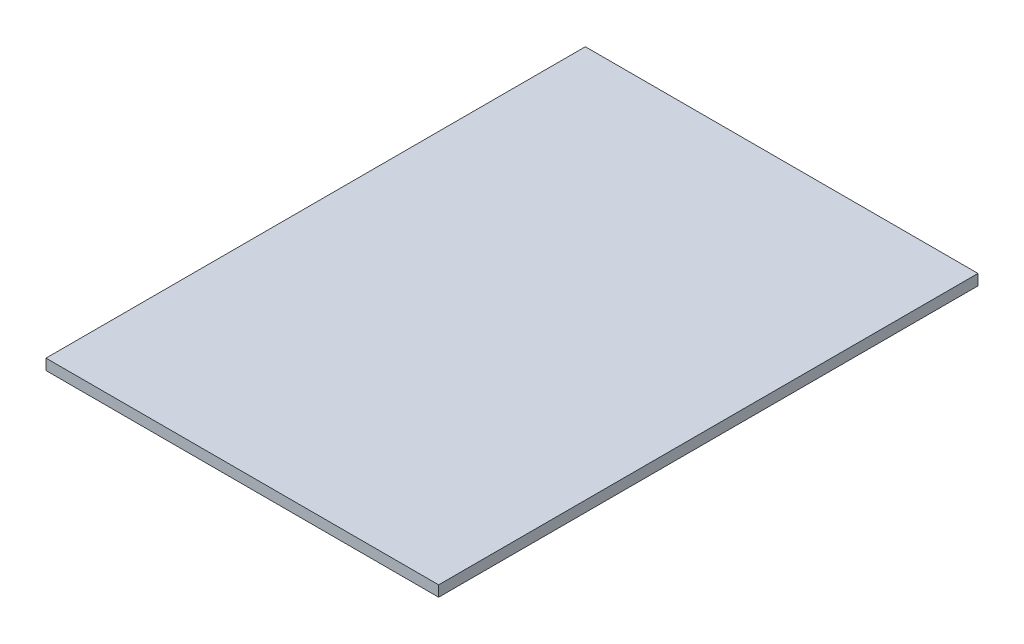
ISO-10303-21;
HEADER;
FILE_DESCRIPTION(('STEP AP214'),'2;1');
FILE_NAME('part.step','',(''),(''),'','','');
FILE_SCHEMA(('AUTOMOTIVE_DESIGN { 1 0 10303 214 1 1 1 1 }'));
ENDSEC;
DATA;
#1=APPLICATION_CONTEXT('core data for automotive mechanical design processes');
#2=APPLICATION_PROTOCOL_DEFINITION('international standard','automotive_design',2000,#1);
#3=PRODUCT_CONTEXT('',#1,'mechanical');
#4=PRODUCT('Part','Part','',(#3));
#5=PRODUCT_RELATED_PRODUCT_CATEGORY('part','',(#4));
#6=PRODUCT_DEFINITION_FORMATION('','',#4);
#7=PRODUCT_DEFINITION_CONTEXT('part definition',#1,'design');
#8=PRODUCT_DEFINITION('design','',#6,#7);
#9=PRODUCT_DEFINITION_SHAPE('','',#8);
#10=(LENGTH_UNIT() NAMED_UNIT(*) SI_UNIT(.MILLI.,.METRE.));
#11=(NAMED_UNIT(*) PLANE_ANGLE_UNIT() SI_UNIT($,.RADIAN.));
#12=(NAMED_UNIT(*) SI_UNIT($,.STERADIAN.) SOLID_ANGLE_UNIT());
#13=UNCERTAINTY_MEASURE_WITH_UNIT(LENGTH_MEASURE(1.E-05),#10,'distance_accuracy_value','');
#14=(GEOMETRIC_REPRESENTATION_CONTEXT(3) GLOBAL_UNCERTAINTY_ASSIGNED_CONTEXT((#13)) GLOBAL_UNIT_ASSIGNED_CONTEXT((#10,
#11,#12)) REPRESENTATION_CONTEXT('',''));
#15=CARTESIAN_POINT('',(0.,0.,0.));
#16=DIRECTION('',(0.,0.,1.));
#17=DIRECTION('',(1.,0.,0.));
#18=AXIS2_PLACEMENT_3D('',#15,#16,#17);
#19=CARTESIAN_POINT('',(1.82,0.1,-2.5));
#20=DIRECTION('',(-1.,0.,0.));
#21=DIRECTION('',(0.,0.,1.));
#22=AXIS2_PLACEMENT_3D('',#19,#20,#21);
#23=PLANE('',#22);
#24=DIRECTION('',(0.,0.,-1.));
#25=VECTOR('',#24,1.);
#26=CARTESIAN_POINT('',(1.82,0.,-2.5));
#27=LINE('',#26,#25);
#28=CARTESIAN_POINT('',(1.82,0.,2.5));
#29=VERTEX_POINT('',#28);
#30=CARTESIAN_POINT('',(1.82,0.,-2.5));
#31=VERTEX_POINT('',#30);
#32=EDGE_CURVE('E98',#29,#31,#27,.T.);
#33=ORIENTED_EDGE('',*,*,#32,.T.);
#34=DIRECTION('',(0.,-1.,0.));
#35=VECTOR('',#34,1.);
#36=CARTESIAN_POINT('',(1.82,0.1,-2.5));
#37=LINE('',#36,#35);
#38=CARTESIAN_POINT('',(1.82,0.1,-2.5));
#39=VERTEX_POINT('',#38);
#40=EDGE_CURVE('E11',#39,#31,#37,.T.);
#41=ORIENTED_EDGE('',*,*,#40,.F.);
#42=DIRECTION('',(0.,0.,-1.));
#43=VECTOR('',#42,1.);
#44=CARTESIAN_POINT('',(1.82,0.1,-2.5));
#45=LINE('',#44,#43);
#46=CARTESIAN_POINT('',(1.82,0.1,2.5));
#47=VERTEX_POINT('',#46);
#48=EDGE_CURVE('E86',#47,#39,#45,.T.);
#49=ORIENTED_EDGE('',*,*,#48,.F.);
#50=DIRECTION('',(0.,-1.,0.));
#51=VECTOR('',#50,1.);
#52=CARTESIAN_POINT('',(1.82,0.1,2.5));
#53=LINE('',#52,#51);
#54=EDGE_CURVE('E94',#47,#29,#53,.T.);
#55=ORIENTED_EDGE('',*,*,#54,.T.);
#56=EDGE_LOOP('',(#33,#41,#49,#55));
#57=FACE_BOUND('',#56,.T.);
#58=ADVANCED_FACE('F35',(#57),#23,.F.);
#59=CARTESIAN_POINT('',(-1.82,0.1,-2.5));
#60=DIRECTION('',(0.,0.,1.));
#61=DIRECTION('',(1.,0.,0.));
#62=AXIS2_PLACEMENT_3D('',#59,#60,#61);
#63=PLANE('',#62);
#64=DIRECTION('',(-1.,0.,0.));
#65=VECTOR('',#64,1.);
#66=CARTESIAN_POINT('',(-1.82,0.,-2.5));
#67=LINE('',#66,#65);
#68=CARTESIAN_POINT('',(-1.82,0.,-2.5));
#69=VERTEX_POINT('',#68);
#70=EDGE_CURVE('E90',#31,#69,#67,.T.);
#71=ORIENTED_EDGE('',*,*,#70,.T.);
#72=DIRECTION('',(0.,-1.,0.));
#73=VECTOR('',#72,1.);
#74=CARTESIAN_POINT('',(-1.82,0.1,-2.5));
#75=LINE('',#74,#73);
#76=CARTESIAN_POINT('',(-1.82,0.1,-2.5));
#77=VERTEX_POINT('',#76);
#78=EDGE_CURVE('E43',#77,#69,#75,.T.);
#79=ORIENTED_EDGE('',*,*,#78,.F.);
#80=DIRECTION('',(-1.,0.,0.));
#81=VECTOR('',#80,1.);
#82=CARTESIAN_POINT('',(-1.82,0.1,-2.5));
#83=LINE('',#82,#81);
#84=EDGE_CURVE('E81',#39,#77,#83,.T.);
#85=ORIENTED_EDGE('',*,*,#84,.F.);
#86=ORIENTED_EDGE('',*,*,#40,.T.);
#87=EDGE_LOOP('',(#71,#79,#85,#86));
#88=FACE_BOUND('',#87,.T.);
#89=ADVANCED_FACE('F89',(#88),#63,.F.);
#90=CARTESIAN_POINT('',(-1.82,0.1,-2.5));
#91=DIRECTION('',(1.,0.,0.));
#92=DIRECTION('',(0.,0.,-1.));
#93=AXIS2_PLACEMENT_3D('',#90,#91,#92);
#94=PLANE('',#93);
#95=DIRECTION('',(0.,0.,1.));
#96=VECTOR('',#95,1.);
#97=CARTESIAN_POINT('',(-1.82,0.,-2.5));
#98=LINE('',#97,#96);
#99=CARTESIAN_POINT('',(-1.82,0.,2.5));
#100=VERTEX_POINT('',#99);
#101=EDGE_CURVE('E68',#69,#100,#98,.T.);
#102=ORIENTED_EDGE('',*,*,#101,.T.);
#103=DIRECTION('',(0.,-1.,0.));
#104=VECTOR('',#103,1.);
#105=CARTESIAN_POINT('',(-1.82,0.1,2.5));
#106=LINE('',#105,#104);
#107=CARTESIAN_POINT('',(-1.82,0.1,2.5));
#108=VERTEX_POINT('',#107);
#109=EDGE_CURVE('E91',#108,#100,#106,.T.);
#110=ORIENTED_EDGE('',*,*,#109,.F.);
#111=DIRECTION('',(0.,0.,1.));
#112=VECTOR('',#111,1.);
#113=CARTESIAN_POINT('',(-1.82,0.1,-2.5));
#114=LINE('',#113,#112);
#115=EDGE_CURVE('E84',#77,#108,#114,.T.);
#116=ORIENTED_EDGE('',*,*,#115,.F.);
#117=ORIENTED_EDGE('',*,*,#78,.T.);
#118=EDGE_LOOP('',(#102,#110,#116,#117));
#119=FACE_BOUND('',#118,.T.);
#120=ADVANCED_FACE('F92',(#119),#94,.F.);
#121=CARTESIAN_POINT('',(-1.82,0.1,2.5));
#122=DIRECTION('',(0.,0.,-1.));
#123=DIRECTION('',(-1.,0.,0.));
#124=AXIS2_PLACEMENT_3D('',#121,#122,#123);
#125=PLANE('',#124);
#126=DIRECTION('',(1.,0.,0.));
#127=VECTOR('',#126,1.);
#128=CARTESIAN_POINT('',(-1.82,0.,2.5));
#129=LINE('',#128,#127);
#130=EDGE_CURVE('E74',#100,#29,#129,.T.);
#131=ORIENTED_EDGE('',*,*,#130,.T.);
#132=ORIENTED_EDGE('',*,*,#54,.F.);
#133=DIRECTION('',(1.,0.,0.));
#134=VECTOR('',#133,1.);
#135=CARTESIAN_POINT('',(-1.82,0.1,2.5));
#136=LINE('',#135,#134);
#137=EDGE_CURVE('E51',#108,#47,#136,.T.);
#138=ORIENTED_EDGE('',*,*,#137,.F.);
#139=ORIENTED_EDGE('',*,*,#109,.T.);
#140=EDGE_LOOP('',(#131,#132,#138,#139));
#141=FACE_BOUND('',#140,.T.);
#142=ADVANCED_FACE('F105',(#141),#125,.F.);
#143=CARTESIAN_POINT('',(0.,0.1,0.));
#144=DIRECTION('',(0.,1.,0.));
#145=DIRECTION('',(0.,0.,1.));
#146=AXIS2_PLACEMENT_3D('',#143,#144,#145);
#147=PLANE('',#146);
#148=ORIENTED_EDGE('',*,*,#48,.T.);
#149=ORIENTED_EDGE('',*,*,#84,.T.);
#150=ORIENTED_EDGE('',*,*,#115,.T.);
#151=ORIENTED_EDGE('',*,*,#137,.T.);
#152=EDGE_LOOP('',(#148,#149,#150,#151));
#153=FACE_BOUND('',#152,.T.);
#154=ADVANCED_FACE('F82',(#153),#147,.T.);
#155=CARTESIAN_POINT('',(0.,0.,0.));
#156=DIRECTION('',(0.,1.,0.));
#157=DIRECTION('',(0.,0.,1.));
#158=AXIS2_PLACEMENT_3D('',#155,#156,#157);
#159=PLANE('',#158);
#160=ORIENTED_EDGE('',*,*,#32,.F.);
#161=ORIENTED_EDGE('',*,*,#130,.F.);
#162=ORIENTED_EDGE('',*,*,#101,.F.);
#163=ORIENTED_EDGE('',*,*,#70,.F.);
#164=EDGE_LOOP('',(#160,#161,#162,#163));
#165=FACE_BOUND('',#164,.T.);
#166=ADVANCED_FACE('F108',(#165),#159,.F.);
#167=CLOSED_SHELL('',(#58,#89,#120,#142,#154,#166));
#168=MANIFOLD_SOLID_BREP('B2',#167);
#169=ADVANCED_BREP_SHAPE_REPRESENTATION('',(#18,#168),#14);
#170=SHAPE_DEFINITION_REPRESENTATION(#9,#169);
ENDSEC;
END-ISO-10303-21;
